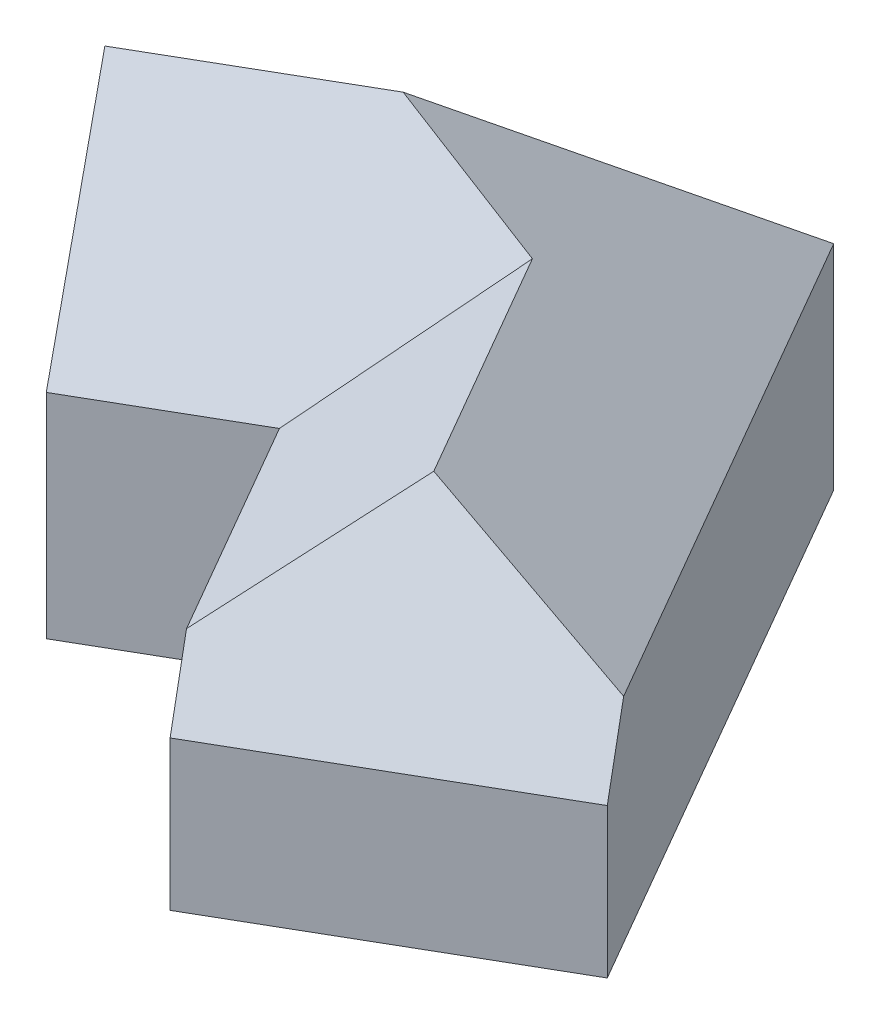
ISO-10303-21;
HEADER;
FILE_DESCRIPTION(('STEP AP214'),'2;1');
FILE_NAME('part.step','',(''),(''),'','','');
FILE_SCHEMA(('AUTOMOTIVE_DESIGN { 1 0 10303 214 1 1 1 1 }'));
ENDSEC;
DATA;
#1=APPLICATION_CONTEXT('core data for automotive mechanical design processes');
#2=APPLICATION_PROTOCOL_DEFINITION('international standard','automotive_design',2000,#1);
#3=PRODUCT_CONTEXT('',#1,'mechanical');
#4=PRODUCT('Part','Part','',(#3));
#5=PRODUCT_RELATED_PRODUCT_CATEGORY('part','',(#4));
#6=PRODUCT_DEFINITION_FORMATION('','',#4);
#7=PRODUCT_DEFINITION_CONTEXT('part definition',#1,'design');
#8=PRODUCT_DEFINITION('design','',#6,#7);
#9=PRODUCT_DEFINITION_SHAPE('','',#8);
#10=(LENGTH_UNIT() NAMED_UNIT(*) SI_UNIT(.MILLI.,.METRE.));
#11=(NAMED_UNIT(*) PLANE_ANGLE_UNIT() SI_UNIT($,.RADIAN.));
#12=(NAMED_UNIT(*) SI_UNIT($,.STERADIAN.) SOLID_ANGLE_UNIT());
#13=UNCERTAINTY_MEASURE_WITH_UNIT(LENGTH_MEASURE(1.E-05),#10,'distance_accuracy_value','');
#14=(GEOMETRIC_REPRESENTATION_CONTEXT(3) GLOBAL_UNCERTAINTY_ASSIGNED_CONTEXT((#13)) GLOBAL_UNIT_ASSIGNED_CONTEXT((#10,
#11,#12)) REPRESENTATION_CONTEXT('',''));
#15=CARTESIAN_POINT('',(0.,0.,0.));
#16=DIRECTION('',(0.,0.,1.));
#17=DIRECTION('',(1.,0.,0.));
#18=AXIS2_PLACEMENT_3D('',#15,#16,#17);
#19=CARTESIAN_POINT('',(-99.5929214352106,50.,57.4999999999998));
#20=DIRECTION('',(0.499999999999998,0.,0.86602540378444));
#21=DIRECTION('',(0.86602540378444,0.,-0.499999999999998));
#22=AXIS2_PLACEMENT_3D('',#19,#20,#21);
#23=PLANE('',#22);
#24=DIRECTION('',(-0.86602540378444,0.,0.499999999999998));
#25=VECTOR('',#24,1.);
#26=CARTESIAN_POINT('',(-99.5929214352106,0.,57.4999999999998));
#27=LINE('',#26,#25);
#28=CARTESIAN_POINT('',(0.,0.,0.));
#29=VERTEX_POINT('',#28);
#30=CARTESIAN_POINT('',(-99.5929214352106,0.,57.4999999999998));
#31=VERTEX_POINT('',#30);
#32=EDGE_CURVE('E187',#29,#31,#27,.T.);
#33=ORIENTED_EDGE('',*,*,#32,.T.);
#34=DIRECTION('',(0.,-1.,0.));
#35=VECTOR('',#34,1.);
#36=CARTESIAN_POINT('',(-99.5929214352106,50.,57.4999999999998));
#37=LINE('',#36,#35);
#38=CARTESIAN_POINT('',(-99.5929214352106,50.,57.4999999999998));
#39=VERTEX_POINT('',#38);
#40=EDGE_CURVE('E129',#39,#31,#37,.T.);
#41=ORIENTED_EDGE('',*,*,#40,.F.);
#42=DIRECTION('',(-0.86602540378444,0.,0.499999999999998));
#43=VECTOR('',#42,1.);
#44=CARTESIAN_POINT('',(-99.5929214352106,50.,57.4999999999998));
#45=LINE('',#44,#43);
#46=CARTESIAN_POINT('',(0.,50.,0.));
#47=VERTEX_POINT('',#46);
#48=EDGE_CURVE('E143',#47,#39,#45,.T.);
#49=ORIENTED_EDGE('',*,*,#48,.F.);
#50=DIRECTION('',(0.,-1.,0.));
#51=VECTOR('',#50,1.);
#52=CARTESIAN_POINT('',(0.,50.,0.));
#53=LINE('',#52,#51);
#54=EDGE_CURVE('E119',#47,#29,#53,.T.);
#55=ORIENTED_EDGE('',*,*,#54,.T.);
#56=EDGE_LOOP('',(#33,#41,#49,#55));
#57=FACE_BOUND('',#56,.T.);
#58=ADVANCED_FACE('F30',(#57),#23,.F.);
#59=CARTESIAN_POINT('',(-62.0929214352107,50.,122.451905283833));
#60=DIRECTION('',(0.86602540378444,0.,-0.499999999999998));
#61=DIRECTION('',(-0.499999999999998,0.,-0.86602540378444));
#62=AXIS2_PLACEMENT_3D('',#59,#60,#61);
#63=PLANE('',#62);
#64=DIRECTION('',(0.499999999999998,0.,0.86602540378444));
#65=VECTOR('',#64,1.);
#66=CARTESIAN_POINT('',(-62.0929214352107,0.,122.451905283833));
#67=LINE('',#66,#65);
#68=CARTESIAN_POINT('',(-62.0929214352107,0.,122.451905283833));
#69=VERTEX_POINT('',#68);
#70=EDGE_CURVE('E190',#31,#69,#67,.T.);
#71=ORIENTED_EDGE('',*,*,#70,.T.);
#72=DIRECTION('',(0.,-1.,0.));
#73=VECTOR('',#72,1.);
#74=CARTESIAN_POINT('',(-62.0929214352107,50.,122.451905283833));
#75=LINE('',#74,#73);
#76=CARTESIAN_POINT('',(-62.0929214352107,50.,122.451905283833));
#77=VERTEX_POINT('',#76);
#78=EDGE_CURVE('E126',#77,#69,#75,.T.);
#79=ORIENTED_EDGE('',*,*,#78,.F.);
#80=DIRECTION('',(-0.321393804843271,0.766044443118975,-0.556670399226424));
#81=VECTOR('',#80,1.);
#82=CARTESIAN_POINT('',(-80.8429214352106,94.6907597222824,89.9759526419163));
#83=LINE('',#82,#81);
#84=CARTESIAN_POINT('',(-80.8429214352106,94.6907597222824,89.9759526419163));
#85=VERTEX_POINT('',#84);
#86=EDGE_CURVE('E165',#77,#85,#83,.T.);
#87=ORIENTED_EDGE('',*,*,#86,.T.);
#88=DIRECTION('',(-0.32139380484327,-0.766044443118975,-0.556670399226424));
#89=VECTOR('',#88,1.);
#90=CARTESIAN_POINT('',(-99.5929214352106,50.,57.4999999999998));
#91=LINE('',#90,#89);
#92=EDGE_CURVE('E182',#85,#39,#91,.T.);
#93=ORIENTED_EDGE('',*,*,#92,.T.);
#94=ORIENTED_EDGE('',*,*,#40,.T.);
#95=EDGE_LOOP('',(#71,#79,#87,#93,#94));
#96=FACE_BOUND('',#95,.T.);
#97=ADVANCED_FACE('F206',(#96),#63,.F.);
#98=CARTESIAN_POINT('',(-27.4519052838331,50.,102.451905283833));
#99=DIRECTION('',(-0.499999999999999,0.,-0.866025403784439));
#100=DIRECTION('',(-0.866025403784439,0.,0.499999999999999));
#101=AXIS2_PLACEMENT_3D('',#98,#99,#100);
#102=PLANE('',#101);
#103=DIRECTION('',(0.866025403784439,0.,-0.499999999999999));
#104=VECTOR('',#103,1.);
#105=CARTESIAN_POINT('',(-27.4519052838331,0.,102.451905283833));
#106=LINE('',#105,#104);
#107=CARTESIAN_POINT('',(-27.4519052838331,0.,102.451905283833));
#108=VERTEX_POINT('',#107);
#109=EDGE_CURVE('E169',#69,#108,#106,.T.);
#110=ORIENTED_EDGE('',*,*,#109,.T.);
#111=DIRECTION('',(0.,-1.,0.));
#112=VECTOR('',#111,1.);
#113=CARTESIAN_POINT('',(-27.4519052838331,50.,102.451905283833));
#114=LINE('',#113,#112);
#115=CARTESIAN_POINT('',(-27.451905283833,50.,102.451905283833));
#116=VERTEX_POINT('',#115);
#117=EDGE_CURVE('E121',#116,#108,#114,.T.);
#118=ORIENTED_EDGE('',*,*,#117,.F.);
#119=DIRECTION('',(0.866025403784439,0.,-0.499999999999999));
#120=VECTOR('',#119,1.);
#121=CARTESIAN_POINT('',(-27.4519052838331,50.,102.451905283833));
#122=LINE('',#121,#120);
#123=EDGE_CURVE('E135',#77,#116,#122,.T.);
#124=ORIENTED_EDGE('',*,*,#123,.F.);
#125=ORIENTED_EDGE('',*,*,#78,.T.);
#126=EDGE_LOOP('',(#110,#118,#124,#125));
#127=FACE_BOUND('',#126,.T.);
#128=ADVANCED_FACE('F167',(#127),#102,.F.);
#129=CARTESIAN_POINT('',(7.54809471616677,50.,163.073683548744));
#130=DIRECTION('',(0.866025403784439,0.,-0.499999999999999));
#131=DIRECTION('',(-0.499999999999999,0.,-0.866025403784439));
#132=AXIS2_PLACEMENT_3D('',#129,#130,#131);
#133=PLANE('',#132);
#134=DIRECTION('',(0.,-1.,0.));
#135=VECTOR('',#134,1.);
#136=CARTESIAN_POINT('',(7.54809471616677,50.,163.073683548744));
#137=LINE('',#136,#135);
#138=CARTESIAN_POINT('',(7.54809471616669,35.,163.073683548744));
#139=VERTEX_POINT('',#138);
#140=CARTESIAN_POINT('',(7.54809471616677,0.,163.073683548744));
#141=VERTEX_POINT('',#140);
#142=EDGE_CURVE('E118',#139,#141,#137,.T.);
#143=ORIENTED_EDGE('',*,*,#142,.F.);
#144=DIRECTION('',(-0.286788218175521,0.819152044288993,-0.496731764892153));
#145=VECTOR('',#144,1.);
#146=CARTESIAN_POINT('',(7.54809471616669,35.,163.073683548744));
#147=LINE('',#146,#145);
#148=CARTESIAN_POINT('',(2.29653817959393,49.9999999999999,153.977720808579));
#149=VERTEX_POINT('',#148);
#150=EDGE_CURVE('E103',#139,#149,#147,.T.);
#151=ORIENTED_EDGE('',*,*,#150,.T.);
#152=DIRECTION('',(0.499999999999999,0.,0.866025403784439));
#153=VECTOR('',#152,1.);
#154=CARTESIAN_POINT('',(7.54809471616677,50.,163.073683548744));
#155=LINE('',#154,#153);
#156=EDGE_CURVE('E132',#116,#149,#155,.T.);
#157=ORIENTED_EDGE('',*,*,#156,.F.);
#158=ORIENTED_EDGE('',*,*,#117,.T.);
#159=DIRECTION('',(0.499999999999999,0.,0.866025403784439));
#160=VECTOR('',#159,1.);
#161=CARTESIAN_POINT('',(7.54809471616677,0.,163.073683548744));
#162=LINE('',#161,#160);
#163=EDGE_CURVE('E193',#108,#141,#162,.T.);
#164=ORIENTED_EDGE('',*,*,#163,.T.);
#165=EDGE_LOOP('',(#143,#151,#157,#158,#164));
#166=FACE_BOUND('',#165,.T.);
#167=ADVANCED_FACE('F173',(#166),#133,.F.);
#168=CARTESIAN_POINT('',(72.4999999999997,50.,125.573683548744));
#169=DIRECTION('',(-0.499999999999998,0.,-0.86602540378444));
#170=DIRECTION('',(-0.86602540378444,0.,0.499999999999998));
#171=AXIS2_PLACEMENT_3D('',#168,#169,#170);
#172=PLANE('',#171);
#173=DIRECTION('',(0.,-1.,0.));
#174=VECTOR('',#173,1.);
#175=CARTESIAN_POINT('',(72.4999999999997,50.,125.573683548744));
#176=LINE('',#175,#174);
#177=CARTESIAN_POINT('',(72.4999999999997,35.,125.573683548744));
#178=VERTEX_POINT('',#177);
#179=CARTESIAN_POINT('',(72.4999999999997,0.,125.573683548744));
#180=VERTEX_POINT('',#179);
#181=EDGE_CURVE('E110',#178,#180,#176,.T.);
#182=ORIENTED_EDGE('',*,*,#181,.F.);
#183=DIRECTION('',(0.86602540378444,0.,-0.499999999999998));
#184=VECTOR('',#183,1.);
#185=CARTESIAN_POINT('',(7.54809471616669,35.,163.073683548744));
#186=LINE('',#185,#184);
#187=EDGE_CURVE('E98',#139,#178,#186,.T.);
#188=ORIENTED_EDGE('',*,*,#187,.F.);
#189=ORIENTED_EDGE('',*,*,#142,.T.);
#190=DIRECTION('',(0.86602540378444,0.,-0.499999999999998));
#191=VECTOR('',#190,1.);
#192=CARTESIAN_POINT('',(72.4999999999997,0.,125.573683548744));
#193=LINE('',#192,#191);
#194=EDGE_CURVE('E116',#141,#180,#193,.T.);
#195=ORIENTED_EDGE('',*,*,#194,.T.);
#196=EDGE_LOOP('',(#182,#188,#189,#195));
#197=FACE_BOUND('',#196,.T.);
#198=ADVANCED_FACE('F114',(#197),#172,.F.);
#199=CARTESIAN_POINT('',(0.,50.,0.));
#200=DIRECTION('',(-0.86602540378444,0.,0.499999999999998));
#201=DIRECTION('',(0.499999999999998,0.,0.86602540378444));
#202=AXIS2_PLACEMENT_3D('',#199,#200,#201);
#203=PLANE('',#202);
#204=DIRECTION('',(-0.499999999999998,0.,-0.86602540378444));
#205=VECTOR('',#204,1.);
#206=CARTESIAN_POINT('',(0.,50.,0.));
#207=LINE('',#206,#205);
#208=CARTESIAN_POINT('',(67.2484434634269,50.,116.477720808579));
#209=VERTEX_POINT('',#208);
#210=EDGE_CURVE('E33',#209,#47,#207,.T.);
#211=ORIENTED_EDGE('',*,*,#210,.F.);
#212=DIRECTION('',(-0.286788218175521,0.819152044288993,-0.496731764892153));
#213=VECTOR('',#212,1.);
#214=CARTESIAN_POINT('',(72.4999999999997,35.,125.573683548744));
#215=LINE('',#214,#213);
#216=EDGE_CURVE('E101',#178,#209,#215,.T.);
#217=ORIENTED_EDGE('',*,*,#216,.F.);
#218=ORIENTED_EDGE('',*,*,#181,.T.);
#219=DIRECTION('',(-0.499999999999998,0.,-0.86602540378444));
#220=VECTOR('',#219,1.);
#221=CARTESIAN_POINT('',(0.,0.,0.));
#222=LINE('',#221,#220);
#223=EDGE_CURVE('E196',#180,#29,#222,.T.);
#224=ORIENTED_EDGE('',*,*,#223,.T.);
#225=ORIENTED_EDGE('',*,*,#54,.F.);
#226=EDGE_LOOP('',(#211,#217,#218,#224,#225));
#227=FACE_BOUND('',#226,.T.);
#228=ADVANCED_FACE('F109',(#227),#203,.F.);
#229=CARTESIAN_POINT('',(0.,0.,0.));
#230=DIRECTION('',(0.,-1.,0.));
#231=DIRECTION('',(0.,0.,-1.));
#232=AXIS2_PLACEMENT_3D('',#229,#230,#231);
#233=PLANE('',#232);
#234=ORIENTED_EDGE('',*,*,#32,.F.);
#235=ORIENTED_EDGE('',*,*,#223,.F.);
#236=ORIENTED_EDGE('',*,*,#194,.F.);
#237=ORIENTED_EDGE('',*,*,#163,.F.);
#238=ORIENTED_EDGE('',*,*,#109,.F.);
#239=ORIENTED_EDGE('',*,*,#70,.F.);
#240=EDGE_LOOP('',(#234,#235,#236,#237,#238,#239));
#241=FACE_BOUND('',#240,.T.);
#242=ADVANCED_FACE('F209',(#241),#233,.T.);
#243=CARTESIAN_POINT('',(18.7499999999999,94.6907597222824,32.4759526419165));
#244=DIRECTION('',(0.383022221559486,0.642787609686544,0.663413948168936));
#245=DIRECTION('',(0.,-0.718183226839562,0.695854045534201));
#246=AXIS2_PLACEMENT_3D('',#243,#244,#245);
#247=PLANE('',#246);
#248=DIRECTION('',(0.856061772623851,-0.516832451593842,0.00651601347519775));
#249=VECTOR('',#248,1.);
#250=CARTESIAN_POINT('',(3.80506030433298,70.3427355900286,64.6954323421316));
#251=LINE('',#250,#249);
#252=CARTESIAN_POINT('',(-36.5240882123037,94.6907597222824,64.388462350501));
#253=VERTEX_POINT('',#252);
#254=CARTESIAN_POINT('',(-5.99240052427876,76.2577826828638,64.620857832647));
#255=VERTEX_POINT('',#254);
#256=EDGE_CURVE('E159',#253,#255,#251,.T.);
#257=ORIENTED_EDGE('',*,*,#256,.F.);
#258=DIRECTION('',(-0.86602540378444,0.,0.499999999999998));
#259=VECTOR('',#258,1.);
#260=CARTESIAN_POINT('',(18.7499999999999,94.6907597222824,32.4759526419165));
#261=LINE('',#260,#259);
#262=EDGE_CURVE('E185',#253,#85,#261,.T.);
#263=ORIENTED_EDGE('',*,*,#262,.T.);
#264=ORIENTED_EDGE('',*,*,#86,.F.);
#265=ORIENTED_EDGE('',*,*,#123,.T.);
#266=DIRECTION('',(-0.422387853111005,-0.516832451593842,0.74462924903859));
#267=VECTOR('',#266,1.);
#268=CARTESIAN_POINT('',(12.5562073502868,98.9538010717855,31.9214422348239));
#269=LINE('',#268,#267);
#270=EDGE_CURVE('E39',#255,#116,#269,.T.);
#271=ORIENTED_EDGE('',*,*,#270,.F.);
#272=EDGE_LOOP('',(#257,#263,#264,#265,#271));
#273=FACE_BOUND('',#272,.T.);
#274=ADVANCED_FACE('F158',(#273),#247,.T.);
#275=CARTESIAN_POINT('',(0.,50.,0.));
#276=DIRECTION('',(-0.383022221559486,0.642787609686543,-0.663413948168936));
#277=DIRECTION('',(0.,0.718183226839562,0.695854045534201));
#278=AXIS2_PLACEMENT_3D('',#275,#276,#277);
#279=PLANE('',#278);
#280=DIRECTION('',(-0.422387853111006,0.516832451593842,0.74462924903859));
#281=VECTOR('',#280,1.);
#282=CARTESIAN_POINT('',(0.,50.,0.));
#283=LINE('',#282,#281);
#284=EDGE_CURVE('E177',#47,#253,#283,.T.);
#285=ORIENTED_EDGE('',*,*,#284,.F.);
#286=ORIENTED_EDGE('',*,*,#48,.T.);
#287=ORIENTED_EDGE('',*,*,#92,.F.);
#288=ORIENTED_EDGE('',*,*,#262,.F.);
#289=EDGE_LOOP('',(#285,#286,#287,#288));
#290=FACE_BOUND('',#289,.T.);
#291=ADVANCED_FACE('F203',(#290),#279,.T.);
#292=CARTESIAN_POINT('',(-12.4759526419166,76.2577826828638,53.3910161513775));
#293=DIRECTION('',(0.496731764892151,0.819152044288995,-0.28678821817552));
#294=DIRECTION('',(-0.855070113272877,0.518512392703887,0.));
#295=AXIS2_PLACEMENT_3D('',#292,#293,#294);
#296=PLANE('',#295);
#297=DIRECTION('',(-0.844642564794278,0.532254036091312,0.0573112449895452));
#298=VECTOR('',#297,1.);
#299=CARTESIAN_POINT('',(1.6206861422228,91.355527379016,120.930738729676));
#300=LINE('',#299,#298);
#301=CARTESIAN_POINT('',(25.5795421359037,76.2577826828638,119.305066613735));
#302=VERTEX_POINT('',#301);
#303=EDGE_CURVE('E45',#209,#302,#300,.T.);
#304=ORIENTED_EDGE('',*,*,#303,.F.);
#305=ORIENTED_EDGE('',*,*,#210,.T.);
#306=ORIENTED_EDGE('',*,*,#284,.T.);
#307=ORIENTED_EDGE('',*,*,#256,.T.);
#308=DIRECTION('',(0.499999999999998,0.,0.86602540378444));
#309=VECTOR('',#308,1.);
#310=CARTESIAN_POINT('',(-12.4759526419166,76.2577826828638,53.3910161513775));
#311=LINE('',#310,#309);
#312=EDGE_CURVE('E155',#255,#302,#311,.T.);
#313=ORIENTED_EDGE('',*,*,#312,.T.);
#314=EDGE_LOOP('',(#304,#305,#306,#307,#313));
#315=FACE_BOUND('',#314,.T.);
#316=ADVANCED_FACE('F231',(#315),#296,.T.);
#317=CARTESIAN_POINT('',(-44.951905283833,50.,72.1410161513774));
#318=DIRECTION('',(-0.496731764892151,0.819152044288995,0.28678821817552));
#319=DIRECTION('',(-0.855070113272877,-0.518512392703887,0.));
#320=AXIS2_PLACEMENT_3D('',#317,#318,#319);
#321=PLANE('',#320);
#322=DIRECTION('',(-0.471954276480602,-0.532254036091312,0.702826295734714));
#323=VECTOR('',#322,1.);
#324=CARTESIAN_POINT('',(18.9177686887932,68.7448603904937,129.22566652814));
#325=LINE('',#324,#323);
#326=EDGE_CURVE('E11',#302,#149,#325,.T.);
#327=ORIENTED_EDGE('',*,*,#326,.F.);
#328=ORIENTED_EDGE('',*,*,#312,.F.);
#329=ORIENTED_EDGE('',*,*,#270,.T.);
#330=ORIENTED_EDGE('',*,*,#156,.T.);
#331=EDGE_LOOP('',(#327,#328,#329,#330));
#332=FACE_BOUND('',#331,.T.);
#333=ADVANCED_FACE('F152',(#332),#321,.T.);
#334=CARTESIAN_POINT('',(7.54809471616669,35.,163.073683548744));
#335=DIRECTION('',(-0.409576022144495,-0.573576436351044,-0.709406479916225));
#336=DIRECTION('',(0.,0.777622657646257,-0.628731263987383));
#337=AXIS2_PLACEMENT_3D('',#334,#335,#336);
#338=PLANE('',#337);
#339=ORIENTED_EDGE('',*,*,#303,.T.);
#340=ORIENTED_EDGE('',*,*,#326,.T.);
#341=ORIENTED_EDGE('',*,*,#150,.F.);
#342=ORIENTED_EDGE('',*,*,#187,.T.);
#343=ORIENTED_EDGE('',*,*,#216,.T.);
#344=EDGE_LOOP('',(#339,#340,#341,#342,#343));
#345=FACE_BOUND('',#344,.T.);
#346=ADVANCED_FACE('F100',(#345),#338,.F.);
#347=CLOSED_SHELL('',(#58,#97,#128,#167,#198,#228,#242,#274,#291,#316,#333,#346));
#348=MANIFOLD_SOLID_BREP('B2',#347);
#349=ADVANCED_BREP_SHAPE_REPRESENTATION('',(#18,#348),#14);
#350=SHAPE_DEFINITION_REPRESENTATION(#9,#349);
ENDSEC;
END-ISO-10303-21;
